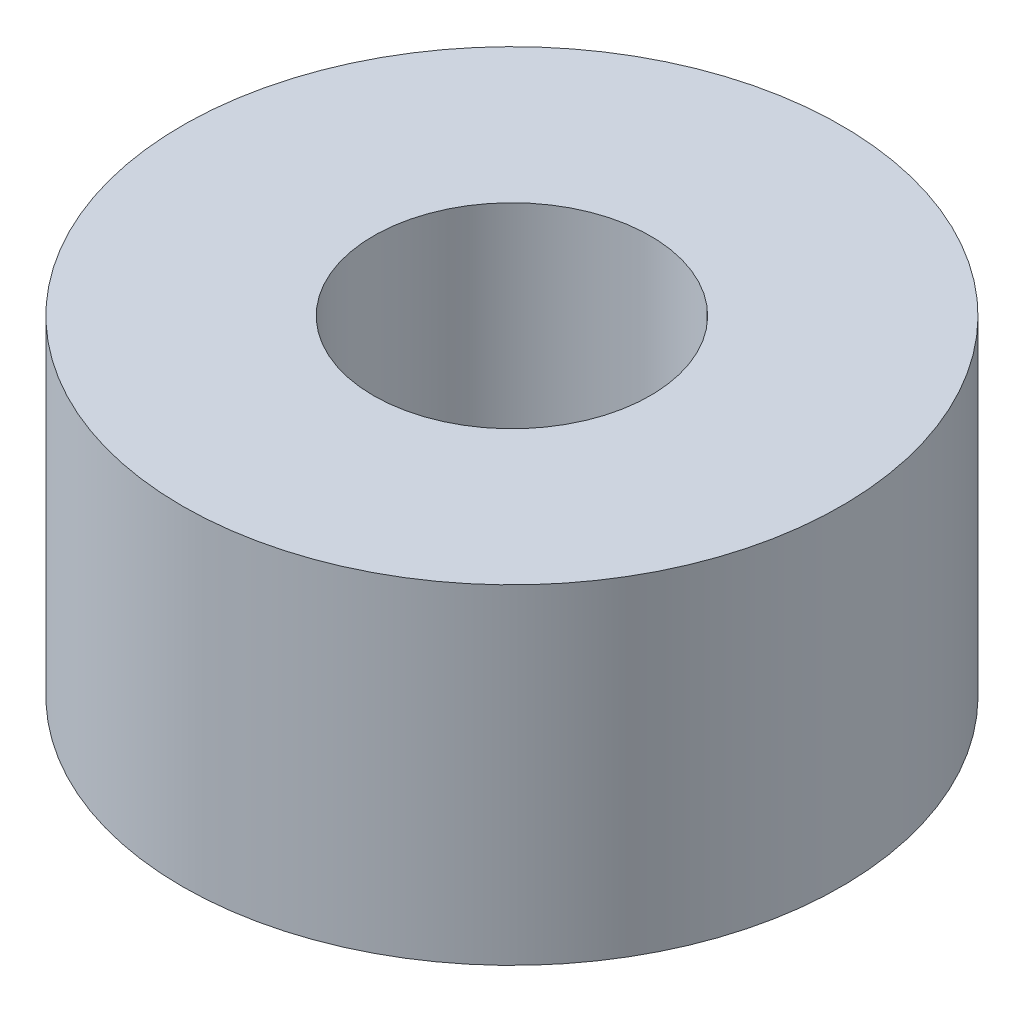
ISO-10303-21;
HEADER;
FILE_DESCRIPTION(('STEP AP214'),'2;1');
FILE_NAME('part.step','',(''),(''),'','','');
FILE_SCHEMA(('AUTOMOTIVE_DESIGN { 1 0 10303 214 1 1 1 1 }'));
ENDSEC;
DATA;
#1=APPLICATION_CONTEXT('core data for automotive mechanical design processes');
#2=APPLICATION_PROTOCOL_DEFINITION('international standard','automotive_design',2000,#1);
#3=PRODUCT_CONTEXT('',#1,'mechanical');
#4=PRODUCT('Part','Part','',(#3));
#5=PRODUCT_RELATED_PRODUCT_CATEGORY('part','',(#4));
#6=PRODUCT_DEFINITION_FORMATION('','',#4);
#7=PRODUCT_DEFINITION_CONTEXT('part definition',#1,'design');
#8=PRODUCT_DEFINITION('design','',#6,#7);
#9=PRODUCT_DEFINITION_SHAPE('','',#8);
#10=(LENGTH_UNIT() NAMED_UNIT(*) SI_UNIT(.MILLI.,.METRE.));
#11=(NAMED_UNIT(*) PLANE_ANGLE_UNIT() SI_UNIT($,.RADIAN.));
#12=(NAMED_UNIT(*) SI_UNIT($,.STERADIAN.) SOLID_ANGLE_UNIT());
#13=UNCERTAINTY_MEASURE_WITH_UNIT(LENGTH_MEASURE(1.E-05),#10,'distance_accuracy_value','');
#14=(GEOMETRIC_REPRESENTATION_CONTEXT(3) GLOBAL_UNCERTAINTY_ASSIGNED_CONTEXT((#13)) GLOBAL_UNIT_ASSIGNED_CONTEXT((#10,
#11,#12)) REPRESENTATION_CONTEXT('',''));
#15=CARTESIAN_POINT('',(0.,0.,0.));
#16=DIRECTION('',(0.,0.,1.));
#17=DIRECTION('',(1.,0.,0.));
#18=AXIS2_PLACEMENT_3D('',#15,#16,#17);
#19=CARTESIAN_POINT('',(0.,4.7625,0.));
#20=DIRECTION('',(0.,1.,0.));
#21=DIRECTION('',(0.,0.,1.));
#22=AXIS2_PLACEMENT_3D('',#19,#20,#21);
#23=CYLINDRICAL_SURFACE('',#22,4.0005);
#24=CARTESIAN_POINT('',(0.,-4.7625,0.));
#25=DIRECTION('',(0.,1.,0.));
#26=DIRECTION('',(0.,0.,1.));
#27=AXIS2_PLACEMENT_3D('',#24,#25,#26);
#28=CIRCLE('',#27,4.0005);
#29=CARTESIAN_POINT('',(0.,-4.7625,4.0005));
#30=VERTEX_POINT('',#29);
#31=EDGE_CURVE('E10',#30,#30,#28,.T.);
#32=ORIENTED_EDGE('',*,*,#31,.F.);
#33=EDGE_LOOP('',(#32));
#34=FACE_BOUND('',#33,.T.);
#35=CARTESIAN_POINT('',(0.,4.7625,0.));
#36=DIRECTION('',(0.,1.,0.));
#37=DIRECTION('',(0.,0.,1.));
#38=AXIS2_PLACEMENT_3D('',#35,#36,#37);
#39=CIRCLE('',#38,4.0005);
#40=CARTESIAN_POINT('',(0.,4.7625,4.0005));
#41=VERTEX_POINT('',#40);
#42=EDGE_CURVE('E43',#41,#41,#39,.T.);
#43=ORIENTED_EDGE('',*,*,#42,.T.);
#44=EDGE_LOOP('',(#43));
#45=FACE_BOUND('',#44,.T.);
#46=ADVANCED_FACE('F29',(#34,#45),#23,.F.);
#47=CARTESIAN_POINT('',(4.0005,-4.7625,0.));
#48=DIRECTION('',(0.,1.,0.));
#49=DIRECTION('',(0.,0.,1.));
#50=AXIS2_PLACEMENT_3D('',#47,#48,#49);
#51=PLANE('',#50);
#52=CARTESIAN_POINT('',(0.,-4.7625,0.));
#53=DIRECTION('',(0.,1.,0.));
#54=DIRECTION('',(0.,0.,1.));
#55=AXIS2_PLACEMENT_3D('',#52,#53,#54);
#56=CIRCLE('',#55,9.525);
#57=CARTESIAN_POINT('',(0.,-4.7625,9.525));
#58=VERTEX_POINT('',#57);
#59=EDGE_CURVE('E35',#58,#58,#56,.T.);
#60=ORIENTED_EDGE('',*,*,#59,.F.);
#61=EDGE_LOOP('',(#60));
#62=FACE_BOUND('',#61,.T.);
#63=ORIENTED_EDGE('',*,*,#31,.T.);
#64=EDGE_LOOP('',(#63));
#65=FACE_BOUND('',#64,.T.);
#66=ADVANCED_FACE('F58',(#62,#65),#51,.F.);
#67=CARTESIAN_POINT('',(0.,4.7625,0.));
#68=DIRECTION('',(0.,1.,0.));
#69=DIRECTION('',(0.,0.,1.));
#70=AXIS2_PLACEMENT_3D('',#67,#68,#69);
#71=CYLINDRICAL_SURFACE('',#70,9.525);
#72=CARTESIAN_POINT('',(0.,4.7625,0.));
#73=DIRECTION('',(0.,1.,0.));
#74=DIRECTION('',(0.,0.,1.));
#75=AXIS2_PLACEMENT_3D('',#72,#73,#74);
#76=CIRCLE('',#75,9.525);
#77=CARTESIAN_POINT('',(0.,4.7625,9.525));
#78=VERTEX_POINT('',#77);
#79=EDGE_CURVE('E39',#78,#78,#76,.T.);
#80=ORIENTED_EDGE('',*,*,#79,.F.);
#81=EDGE_LOOP('',(#80));
#82=FACE_BOUND('',#81,.T.);
#83=ORIENTED_EDGE('',*,*,#59,.T.);
#84=EDGE_LOOP('',(#83));
#85=FACE_BOUND('',#84,.T.);
#86=ADVANCED_FACE('F53',(#82,#85),#71,.T.);
#87=CARTESIAN_POINT('',(4.0005,4.7625,0.));
#88=DIRECTION('',(0.,-1.,0.));
#89=DIRECTION('',(0.,0.,-1.));
#90=AXIS2_PLACEMENT_3D('',#87,#88,#89);
#91=PLANE('',#90);
#92=ORIENTED_EDGE('',*,*,#42,.F.);
#93=EDGE_LOOP('',(#92));
#94=FACE_BOUND('',#93,.T.);
#95=ORIENTED_EDGE('',*,*,#79,.T.);
#96=EDGE_LOOP('',(#95));
#97=FACE_BOUND('',#96,.T.);
#98=ADVANCED_FACE('F50',(#94,#97),#91,.F.);
#99=CLOSED_SHELL('',(#46,#66,#86,#98));
#100=MANIFOLD_SOLID_BREP('B2',#99);
#101=ADVANCED_BREP_SHAPE_REPRESENTATION('',(#18,#100),#14);
#102=SHAPE_DEFINITION_REPRESENTATION(#9,#101);
ENDSEC;
END-ISO-10303-21;
